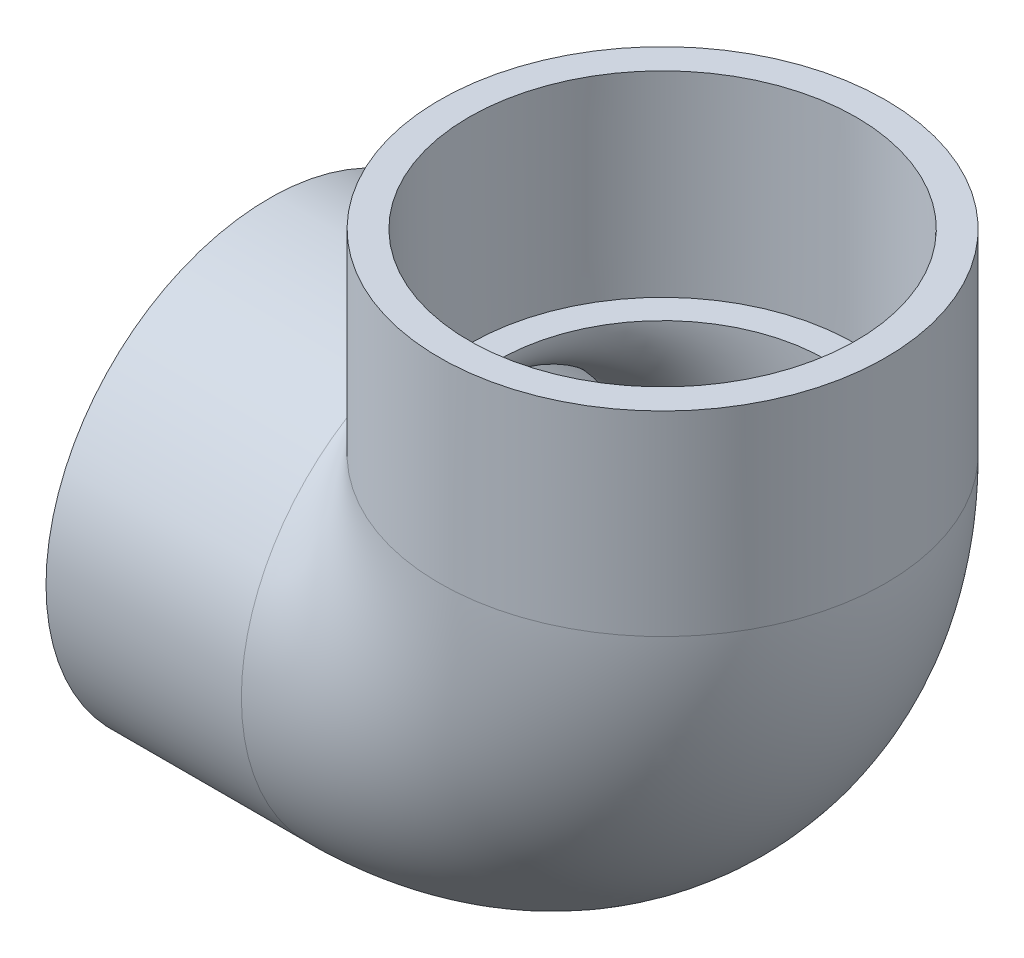
ISO-10303-21;
HEADER;
FILE_DESCRIPTION(('STEP AP214'),'2;1');
FILE_NAME('part.step','',(''),(''),'','','');
FILE_SCHEMA(('AUTOMOTIVE_DESIGN { 1 0 10303 214 1 1 1 1 }'));
ENDSEC;
DATA;
#1=APPLICATION_CONTEXT('core data for automotive mechanical design processes');
#2=APPLICATION_PROTOCOL_DEFINITION('international standard','automotive_design',2000,#1);
#3=PRODUCT_CONTEXT('',#1,'mechanical');
#4=PRODUCT('Part','Part','',(#3));
#5=PRODUCT_RELATED_PRODUCT_CATEGORY('part','',(#4));
#6=PRODUCT_DEFINITION_FORMATION('','',#4);
#7=PRODUCT_DEFINITION_CONTEXT('part definition',#1,'design');
#8=PRODUCT_DEFINITION('design','',#6,#7);
#9=PRODUCT_DEFINITION_SHAPE('','',#8);
#10=(LENGTH_UNIT() NAMED_UNIT(*) SI_UNIT(.MILLI.,.METRE.));
#11=(NAMED_UNIT(*) PLANE_ANGLE_UNIT() SI_UNIT($,.RADIAN.));
#12=(NAMED_UNIT(*) SI_UNIT($,.STERADIAN.) SOLID_ANGLE_UNIT());
#13=UNCERTAINTY_MEASURE_WITH_UNIT(LENGTH_MEASURE(1.E-05),#10,'distance_accuracy_value','');
#14=(GEOMETRIC_REPRESENTATION_CONTEXT(3) GLOBAL_UNCERTAINTY_ASSIGNED_CONTEXT((#13)) GLOBAL_UNIT_ASSIGNED_CONTEXT((#10,
#11,#12)) REPRESENTATION_CONTEXT('',''));
#15=CARTESIAN_POINT('',(0.,0.,0.));
#16=DIRECTION('',(0.,0.,1.));
#17=DIRECTION('',(1.,0.,0.));
#18=AXIS2_PLACEMENT_3D('',#15,#16,#17);
#19=CARTESIAN_POINT('',(-116.6368,-66.1416,0.));
#20=DIRECTION('',(-1.,0.,0.));
#21=DIRECTION('',(0.,0.,1.));
#22=AXIS2_PLACEMENT_3D('',#19,#20,#21);
#23=PLANE('',#22);
#24=CARTESIAN_POINT('',(-116.6368,0.,0.));
#25=DIRECTION('',(-1.,0.,0.));
#26=DIRECTION('',(0.,0.,1.));
#27=AXIS2_PLACEMENT_3D('',#24,#25,#26);
#28=CIRCLE('',#27,66.1416);
#29=CARTESIAN_POINT('',(-116.6368,0.,66.1416));
#30=VERTEX_POINT('',#29);
#31=EDGE_CURVE('E52',#30,#30,#28,.T.);
#32=ORIENTED_EDGE('',*,*,#31,.T.);
#33=EDGE_LOOP('',(#32));
#34=FACE_BOUND('',#33,.T.);
#35=CARTESIAN_POINT('',(-116.6368,0.,0.));
#36=DIRECTION('',(-1.,0.,0.));
#37=DIRECTION('',(0.,0.,1.));
#38=AXIS2_PLACEMENT_3D('',#35,#36,#37);
#39=CIRCLE('',#38,57.3786);
#40=CARTESIAN_POINT('',(-116.6368,0.,57.3786));
#41=VERTEX_POINT('',#40);
#42=EDGE_CURVE('E39',#41,#41,#39,.T.);
#43=ORIENTED_EDGE('',*,*,#42,.F.);
#44=EDGE_LOOP('',(#43));
#45=FACE_BOUND('',#44,.T.);
#46=ADVANCED_FACE('F32',(#34,#45),#23,.T.);
#47=CARTESIAN_POINT('',(-58.7248,0.,0.));
#48=DIRECTION('',(-1.,0.,0.));
#49=DIRECTION('',(0.,0.,1.));
#50=AXIS2_PLACEMENT_3D('',#47,#48,#49);
#51=CONICAL_SURFACE('',#50,57.0357,0.00592098343790762);
#52=ORIENTED_EDGE('',*,*,#42,.T.);
#53=EDGE_LOOP('',(#52));
#54=FACE_BOUND('',#53,.T.);
#55=CARTESIAN_POINT('',(-58.7248,0.,0.));
#56=DIRECTION('',(-1.,0.,0.));
#57=DIRECTION('',(0.,0.,1.));
#58=AXIS2_PLACEMENT_3D('',#55,#56,#57);
#59=CIRCLE('',#58,57.0357);
#60=CARTESIAN_POINT('',(-58.7248,0.,57.0357));
#61=VERTEX_POINT('',#60);
#62=EDGE_CURVE('E63',#61,#61,#59,.T.);
#63=ORIENTED_EDGE('',*,*,#62,.F.);
#64=EDGE_LOOP('',(#63));
#65=FACE_BOUND('',#64,.T.);
#66=ADVANCED_FACE('F72',(#54,#65),#51,.F.);
#67=CARTESIAN_POINT('',(-116.6368,0.,0.));
#68=DIRECTION('',(-1.,0.,0.));
#69=DIRECTION('',(0.,0.,1.));
#70=AXIS2_PLACEMENT_3D('',#67,#68,#69);
#71=CYLINDRICAL_SURFACE('',#70,66.1416);
#72=CARTESIAN_POINT('',(0.,0.,0.));
#73=DIRECTION('',(-0.707106781186547,-0.707106781186547,0.));
#74=DIRECTION('',(-0.707106781186547,0.707106781186547,0.));
#75=AXIS2_PLACEMENT_3D('',#72,#73,#74);
#76=ELLIPSE('',#75,93.5383477570563,66.1416);
#77=CARTESIAN_POINT('',(-58.7248,58.7248,-30.4320409358295));
#78=VERTEX_POINT('',#77);
#79=CARTESIAN_POINT('',(-58.7248,58.7248,30.4320409358294));
#80=VERTEX_POINT('',#79);
#81=EDGE_CURVE('E51',#78,#80,#76,.F.);
#82=ORIENTED_EDGE('',*,*,#81,.F.);
#83=CARTESIAN_POINT('',(-58.7248,0.,0.));
#84=DIRECTION('',(-1.,0.,0.));
#85=DIRECTION('',(0.,0.,1.));
#86=AXIS2_PLACEMENT_3D('',#83,#84,#85);
#87=CIRCLE('',#86,66.1416);
#88=EDGE_CURVE('E58',#78,#80,#87,.T.);
#89=ORIENTED_EDGE('',*,*,#88,.T.);
#90=EDGE_LOOP('',(#82,#89));
#91=FACE_BOUND('',#90,.T.);
#92=ORIENTED_EDGE('',*,*,#31,.F.);
#93=EDGE_LOOP('',(#92));
#94=FACE_BOUND('',#93,.T.);
#95=ADVANCED_FACE('F56',(#91,#94),#71,.T.);
#96=CARTESIAN_POINT('',(-58.7248,58.7248,0.));
#97=DIRECTION('',(0.,0.,-1.));
#98=DIRECTION('',(-1.,0.,0.));
#99=AXIS2_PLACEMENT_3D('',#96,#97,#98);
#100=TOROIDAL_SURFACE('',#99,58.7248,48.5902);
#101=CARTESIAN_POINT('',(0.,58.7248,0.));
#102=DIRECTION('',(0.,1.,0.));
#103=DIRECTION('',(0.,0.,-1.));
#104=AXIS2_PLACEMENT_3D('',#101,#102,#103);
#105=CIRCLE('',#104,48.5902);
#106=CARTESIAN_POINT('',(48.5902,58.7248000000001,0.));
#107=VERTEX_POINT('',#106);
#108=EDGE_CURVE('E53',#107,#107,#105,.T.);
#109=CARTESIAN_POINT('',(-58.7248,0.,0.));
#110=DIRECTION('',(1.,0.,0.));
#111=DIRECTION('',(0.,0.,-1.));
#112=AXIS2_PLACEMENT_3D('',#109,#110,#111);
#113=CIRCLE('',#112,48.5902);
#114=CARTESIAN_POINT('',(-58.7248,-48.5902,0.));
#115=VERTEX_POINT('',#114);
#116=EDGE_CURVE('E59',#115,#115,#113,.T.);
#117=CARTESIAN_POINT('',(-58.7248,58.7248,0.));
#118=DIRECTION('',(0.,0.,-1.));
#119=DIRECTION('',(-1.,0.,0.));
#120=AXIS2_PLACEMENT_3D('',#117,#118,#119);
#121=CIRCLE('',#120,107.315);
#122=EDGE_CURVE('',#107,#115,#121,.T.);
#123=ORIENTED_EDGE('',*,*,#108,.T.);
#124=ORIENTED_EDGE('',*,*,#116,.F.);
#125=ORIENTED_EDGE('',*,*,#122,.T.);
#126=ORIENTED_EDGE('',*,*,#122,.F.);
#127=EDGE_LOOP('',(#123,#125,#124,#126));
#128=FACE_BOUND('',#127,.T.);
#129=ADVANCED_FACE('F82',(#128),#100,.F.);
#130=CARTESIAN_POINT('',(-117.4496,58.7248,0.));
#131=DIRECTION('',(0.,-1.,0.));
#132=DIRECTION('',(-1.,0.,0.));
#133=AXIS2_PLACEMENT_3D('',#130,#131,#132);
#134=CIRCLE('',#133,66.1416);
#135=TRIMMED_CURVE('',#134,(PARAMETER_VALUE(-2.66347987739512)),
(PARAMETER_VALUE(2.66347987739512)),.T.,.PARAMETER.);
#136=CARTESIAN_POINT('',(-58.7248,58.7248,0.));
#137=DIRECTION('',(0.,0.,-1.));
#138=AXIS1_PLACEMENT('',#136,#137);
#139=SURFACE_OF_REVOLUTION('',#135,#138);
#140=CARTESIAN_POINT('',(0.,58.7248,0.));
#141=DIRECTION('',(0.,1.,0.));
#142=DIRECTION('',(0.,0.,-1.));
#143=AXIS2_PLACEMENT_3D('',#140,#141,#142);
#144=CIRCLE('',#143,66.1416);
#145=EDGE_CURVE('E45',#80,#78,#144,.T.);
#146=ORIENTED_EDGE('',*,*,#145,.F.);
#147=ORIENTED_EDGE('',*,*,#88,.F.);
#148=EDGE_LOOP('',(#146,#147));
#149=FACE_BOUND('',#148,.T.);
#150=ADVANCED_FACE('F62',(#149),#139,.T.);
#151=CARTESIAN_POINT('',(0.,58.7248,0.));
#152=DIRECTION('',(0.,1.,0.));
#153=DIRECTION('',(0.,0.,-1.));
#154=AXIS2_PLACEMENT_3D('',#151,#152,#153);
#155=PLANE('',#154);
#156=CARTESIAN_POINT('',(0.,58.7248,0.));
#157=DIRECTION('',(0.,1.,0.));
#158=DIRECTION('',(-1.,0.,0.));
#159=AXIS2_PLACEMENT_3D('',#156,#157,#158);
#160=CIRCLE('',#159,57.0357);
#161=CARTESIAN_POINT('',(-57.0357,58.7248,0.));
#162=VERTEX_POINT('',#161);
#163=EDGE_CURVE('E11',#162,#162,#160,.F.);
#164=ORIENTED_EDGE('',*,*,#163,.F.);
#165=EDGE_LOOP('',(#164));
#166=FACE_BOUND('',#165,.T.);
#167=ORIENTED_EDGE('',*,*,#108,.F.);
#168=EDGE_LOOP('',(#167));
#169=FACE_BOUND('',#168,.T.);
#170=ADVANCED_FACE('F91',(#166,#169),#155,.T.);
#171=CARTESIAN_POINT('',(-58.7248,0.,0.));
#172=DIRECTION('',(1.,0.,0.));
#173=DIRECTION('',(0.,0.,-1.));
#174=AXIS2_PLACEMENT_3D('',#171,#172,#173);
#175=PLANE('',#174);
#176=ORIENTED_EDGE('',*,*,#62,.T.);
#177=EDGE_LOOP('',(#176));
#178=FACE_BOUND('',#177,.T.);
#179=ORIENTED_EDGE('',*,*,#116,.T.);
#180=EDGE_LOOP('',(#179));
#181=FACE_BOUND('',#180,.T.);
#182=ADVANCED_FACE('F95',(#178,#181),#175,.F.);
#183=CARTESIAN_POINT('',(66.1416,116.6368,0.));
#184=DIRECTION('',(0.,1.,0.));
#185=DIRECTION('',(0.,0.,1.));
#186=AXIS2_PLACEMENT_3D('',#183,#184,#185);
#187=PLANE('',#186);
#188=CARTESIAN_POINT('',(0.,116.6368,0.));
#189=DIRECTION('',(0.,-1.,0.));
#190=DIRECTION('',(0.,0.,-1.));
#191=AXIS2_PLACEMENT_3D('',#188,#189,#190);
#192=CIRCLE('',#191,57.3786);
#193=CARTESIAN_POINT('',(0.,116.6368,-57.3786));
#194=VERTEX_POINT('',#193);
#195=EDGE_CURVE('E116',#194,#194,#192,.T.);
#196=ORIENTED_EDGE('',*,*,#195,.T.);
#197=EDGE_LOOP('',(#196));
#198=FACE_BOUND('',#197,.T.);
#199=CARTESIAN_POINT('',(0.,116.6368,0.));
#200=DIRECTION('',(0.,-1.,0.));
#201=DIRECTION('',(0.,0.,-1.));
#202=AXIS2_PLACEMENT_3D('',#199,#200,#201);
#203=CIRCLE('',#202,66.1416);
#204=CARTESIAN_POINT('',(0.,116.6368,-66.1416));
#205=VERTEX_POINT('',#204);
#206=EDGE_CURVE('E60',#205,#205,#203,.T.);
#207=ORIENTED_EDGE('',*,*,#206,.F.);
#208=EDGE_LOOP('',(#207));
#209=FACE_BOUND('',#208,.T.);
#210=ADVANCED_FACE('F99',(#198,#209),#187,.T.);
#211=CARTESIAN_POINT('',(0.,0.,0.));
#212=DIRECTION('',(0.,-1.,0.));
#213=DIRECTION('',(0.,0.,-1.));
#214=AXIS2_PLACEMENT_3D('',#211,#212,#213);
#215=CYLINDRICAL_SURFACE('',#214,66.1416);
#216=ORIENTED_EDGE('',*,*,#206,.T.);
#217=EDGE_LOOP('',(#216));
#218=FACE_BOUND('',#217,.T.);
#219=ORIENTED_EDGE('',*,*,#145,.T.);
#220=ORIENTED_EDGE('',*,*,#81,.T.);
#221=EDGE_LOOP('',(#219,#220));
#222=FACE_BOUND('',#221,.T.);
#223=ADVANCED_FACE('F50',(#218,#222),#215,.T.);
#224=CARTESIAN_POINT('',(0.,116.6368,0.));
#225=DIRECTION('',(0.,1.,0.));
#226=DIRECTION('',(0.,0.,1.));
#227=AXIS2_PLACEMENT_3D('',#224,#225,#226);
#228=CONICAL_SURFACE('',#227,57.3786,0.00592098343790761);
#229=ORIENTED_EDGE('',*,*,#163,.T.);
#230=EDGE_LOOP('',(#229));
#231=FACE_BOUND('',#230,.T.);
#232=ORIENTED_EDGE('',*,*,#195,.F.);
#233=EDGE_LOOP('',(#232));
#234=FACE_BOUND('',#233,.T.);
#235=ADVANCED_FACE('F106',(#231,#234),#228,.F.);
#236=CLOSED_SHELL('',(#46,#66,#95,#129,#150,#170,#182,#210,#223,#235));
#237=MANIFOLD_SOLID_BREP('B2',#236);
#238=ADVANCED_BREP_SHAPE_REPRESENTATION('',(#18,#237),#14);
#239=SHAPE_DEFINITION_REPRESENTATION(#9,#238);
ENDSEC;
END-ISO-10303-21;
